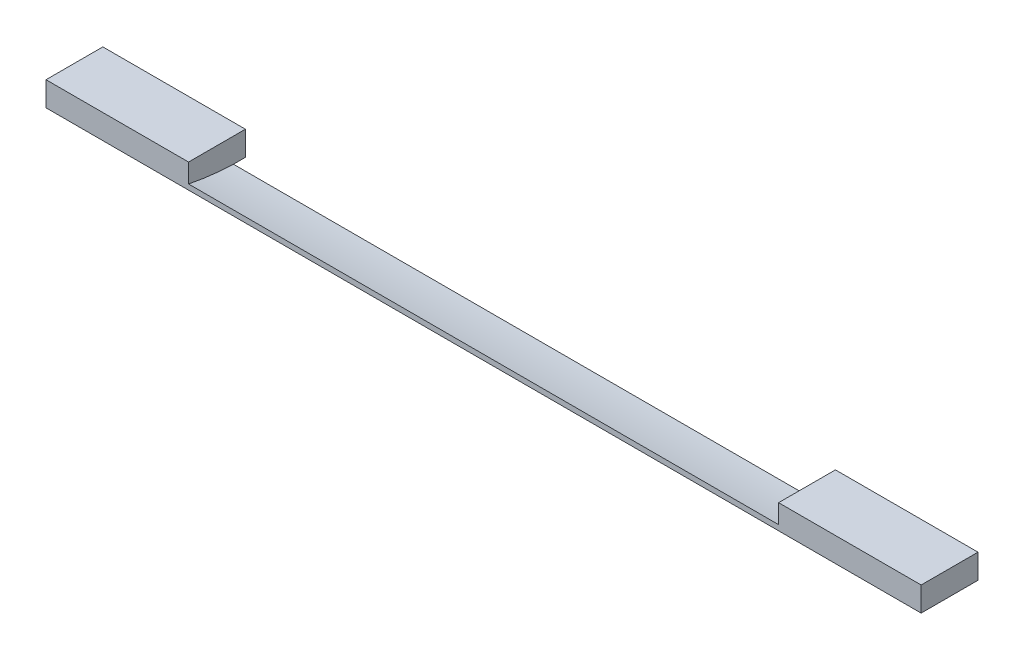
ISO-10303-21;
HEADER;
FILE_DESCRIPTION(('STEP AP214'),'2;1');
FILE_NAME('part.step','',(''),(''),'','','');
FILE_SCHEMA(('AUTOMOTIVE_DESIGN { 1 0 10303 214 1 1 1 1 }'));
ENDSEC;
DATA;
#1=APPLICATION_CONTEXT('core data for automotive mechanical design processes');
#2=APPLICATION_PROTOCOL_DEFINITION('international standard','automotive_design',2000,#1);
#3=PRODUCT_CONTEXT('',#1,'mechanical');
#4=PRODUCT('Part','Part','',(#3));
#5=PRODUCT_RELATED_PRODUCT_CATEGORY('part','',(#4));
#6=PRODUCT_DEFINITION_FORMATION('','',#4);
#7=PRODUCT_DEFINITION_CONTEXT('part definition',#1,'design');
#8=PRODUCT_DEFINITION('design','',#6,#7);
#9=PRODUCT_DEFINITION_SHAPE('','',#8);
#10=(LENGTH_UNIT() NAMED_UNIT(*) SI_UNIT(.MILLI.,.METRE.));
#11=(NAMED_UNIT(*) PLANE_ANGLE_UNIT() SI_UNIT($,.RADIAN.));
#12=(NAMED_UNIT(*) SI_UNIT($,.STERADIAN.) SOLID_ANGLE_UNIT());
#13=UNCERTAINTY_MEASURE_WITH_UNIT(LENGTH_MEASURE(1.E-05),#10,'distance_accuracy_value','');
#14=(GEOMETRIC_REPRESENTATION_CONTEXT(3) GLOBAL_UNCERTAINTY_ASSIGNED_CONTEXT((#13)) GLOBAL_UNIT_ASSIGNED_CONTEXT((#10,
#11,#12)) REPRESENTATION_CONTEXT('',''));
#15=CARTESIAN_POINT('',(0.,0.,0.));
#16=DIRECTION('',(0.,0.,1.));
#17=DIRECTION('',(1.,0.,0.));
#18=AXIS2_PLACEMENT_3D('',#15,#16,#17);
#19=CARTESIAN_POINT('',(-684.2125,38.1,0.));
#20=DIRECTION('',(0.,0.,-1.));
#21=DIRECTION('',(-1.,0.,0.));
#22=AXIS2_PLACEMENT_3D('',#19,#20,#21);
#23=PLANE('',#22);
#24=DIRECTION('',(0.,1.,0.));
#25=VECTOR('',#24,1.);
#26=CARTESIAN_POINT('',(461.3021,8.34320167705216,0.));
#27=LINE('',#26,#25);
#28=CARTESIAN_POINT('',(461.3021,8.34320167705216,-2.08166817117217E-13));
#29=VERTEX_POINT('',#28);
#30=CARTESIAN_POINT('',(461.3021,38.1,0.));
#31=VERTEX_POINT('',#30);
#32=EDGE_CURVE('E188',#29,#31,#27,.T.);
#33=ORIENTED_EDGE('',*,*,#32,.F.);
#34=DIRECTION('',(-1.,0.,0.));
#35=VECTOR('',#34,1.);
#36=CARTESIAN_POINT('',(461.3021,8.34320167705216,-2.08166817117217E-13));
#37=LINE('',#36,#35);
#38=CARTESIAN_POINT('',(-461.3021,8.34320167705216,-2.08166817117217E-13));
#39=VERTEX_POINT('',#38);
#40=EDGE_CURVE('E170',#29,#39,#37,.T.);
#41=ORIENTED_EDGE('',*,*,#40,.T.);
#42=DIRECTION('',(0.,1.,0.));
#43=VECTOR('',#42,1.);
#44=CARTESIAN_POINT('',(-461.3021,8.34320167705216,0.));
#45=LINE('',#44,#43);
#46=CARTESIAN_POINT('',(-461.3021,38.1,0.));
#47=VERTEX_POINT('',#46);
#48=EDGE_CURVE('E180',#39,#47,#45,.T.);
#49=ORIENTED_EDGE('',*,*,#48,.T.);
#50=DIRECTION('',(1.,0.,0.));
#51=VECTOR('',#50,1.);
#52=CARTESIAN_POINT('',(-684.2125,38.1,0.));
#53=LINE('',#52,#51);
#54=CARTESIAN_POINT('',(-684.2125,38.1,0.));
#55=VERTEX_POINT('',#54);
#56=EDGE_CURVE('E92',#55,#47,#53,.T.);
#57=ORIENTED_EDGE('',*,*,#56,.F.);
#58=DIRECTION('',(0.,-1.,0.));
#59=VECTOR('',#58,1.);
#60=CARTESIAN_POINT('',(-684.2125,38.1,0.));
#61=LINE('',#60,#59);
#62=CARTESIAN_POINT('',(-684.2125,0.,0.));
#63=VERTEX_POINT('',#62);
#64=EDGE_CURVE('E11',#55,#63,#61,.T.);
#65=ORIENTED_EDGE('',*,*,#64,.T.);
#66=DIRECTION('',(1.,0.,0.));
#67=VECTOR('',#66,1.);
#68=CARTESIAN_POINT('',(-684.2125,0.,0.));
#69=LINE('',#68,#67);
#70=CARTESIAN_POINT('',(684.2125,0.,0.));
#71=VERTEX_POINT('',#70);
#72=EDGE_CURVE('E167',#63,#71,#69,.T.);
#73=ORIENTED_EDGE('',*,*,#72,.T.);
#74=DIRECTION('',(0.,-1.,0.));
#75=VECTOR('',#74,1.);
#76=CARTESIAN_POINT('',(684.2125,38.1,0.));
#77=LINE('',#76,#75);
#78=CARTESIAN_POINT('',(684.2125,38.1,0.));
#79=VERTEX_POINT('',#78);
#80=EDGE_CURVE('E47',#79,#71,#77,.T.);
#81=ORIENTED_EDGE('',*,*,#80,.F.);
#82=EDGE_CURVE('E150',#31,#79,#53,.T.);
#83=ORIENTED_EDGE('',*,*,#82,.F.);
#84=EDGE_LOOP('',(#33,#41,#49,#57,#65,#73,#81,#83));
#85=FACE_BOUND('',#84,.T.);
#86=ADVANCED_FACE('F39',(#85),#23,.F.);
#87=CARTESIAN_POINT('',(-684.2125,38.1,-88.9));
#88=DIRECTION('',(0.,0.,1.));
#89=DIRECTION('',(1.,0.,0.));
#90=AXIS2_PLACEMENT_3D('',#87,#88,#89);
#91=PLANE('',#90);
#92=DIRECTION('',(0.,-1.,0.));
#93=VECTOR('',#92,1.);
#94=CARTESIAN_POINT('',(461.3021,38.1,-88.9));
#95=LINE('',#94,#93);
#96=CARTESIAN_POINT('',(461.3021,38.1,-88.9));
#97=VERTEX_POINT('',#96);
#98=CARTESIAN_POINT('',(461.3021,0.,-88.9));
#99=VERTEX_POINT('',#98);
#100=EDGE_CURVE('E121',#97,#99,#95,.T.);
#101=ORIENTED_EDGE('',*,*,#100,.F.);
#102=DIRECTION('',(-1.,0.,0.));
#103=VECTOR('',#102,1.);
#104=CARTESIAN_POINT('',(-684.2125,38.1,-88.9));
#105=LINE('',#104,#103);
#106=CARTESIAN_POINT('',(684.2125,38.1,-88.9));
#107=VERTEX_POINT('',#106);
#108=EDGE_CURVE('E158',#107,#97,#105,.T.);
#109=ORIENTED_EDGE('',*,*,#108,.F.);
#110=DIRECTION('',(0.,-1.,0.));
#111=VECTOR('',#110,1.);
#112=CARTESIAN_POINT('',(684.2125,38.1,-88.9));
#113=LINE('',#112,#111);
#114=CARTESIAN_POINT('',(684.2125,0.,-88.9));
#115=VERTEX_POINT('',#114);
#116=EDGE_CURVE('E147',#107,#115,#113,.T.);
#117=ORIENTED_EDGE('',*,*,#116,.T.);
#118=DIRECTION('',(-1.,0.,0.));
#119=VECTOR('',#118,1.);
#120=CARTESIAN_POINT('',(-684.2125,0.,-88.9));
#121=LINE('',#120,#119);
#122=EDGE_CURVE('E139',#115,#99,#121,.T.);
#123=ORIENTED_EDGE('',*,*,#122,.T.);
#124=EDGE_LOOP('',(#101,#109,#117,#123));
#125=FACE_BOUND('',#124,.T.);
#126=ADVANCED_FACE('F145',(#125),#91,.F.);
#127=CARTESIAN_POINT('',(0.,38.1,0.));
#128=DIRECTION('',(0.,-1.,0.));
#129=DIRECTION('',(0.,0.,-1.));
#130=AXIS2_PLACEMENT_3D('',#127,#128,#129);
#131=PLANE('',#130);
#132=DIRECTION('',(0.,0.,-1.));
#133=VECTOR('',#132,1.);
#134=CARTESIAN_POINT('',(461.3021,38.1,0.));
#135=LINE('',#134,#133);
#136=EDGE_CURVE('E128',#31,#97,#135,.T.);
#137=ORIENTED_EDGE('',*,*,#136,.F.);
#138=ORIENTED_EDGE('',*,*,#82,.T.);
#139=DIRECTION('',(0.,0.,-1.));
#140=VECTOR('',#139,1.);
#141=CARTESIAN_POINT('',(684.2125,38.1,0.));
#142=LINE('',#141,#140);
#143=EDGE_CURVE('E164',#79,#107,#142,.T.);
#144=ORIENTED_EDGE('',*,*,#143,.T.);
#145=ORIENTED_EDGE('',*,*,#108,.T.);
#146=EDGE_LOOP('',(#137,#138,#144,#145));
#147=FACE_BOUND('',#146,.T.);
#148=ADVANCED_FACE('F193',(#147),#131,.F.);
#149=CARTESIAN_POINT('',(0.,0.,0.));
#150=DIRECTION('',(0.,-1.,0.));
#151=DIRECTION('',(0.,0.,-1.));
#152=AXIS2_PLACEMENT_3D('',#149,#150,#151);
#153=PLANE('',#152);
#154=DIRECTION('',(-1.,0.,0.));
#155=VECTOR('',#154,1.);
#156=CARTESIAN_POINT('',(461.3021,0.,-70.1926972878016));
#157=LINE('',#156,#155);
#158=CARTESIAN_POINT('',(461.3021,0.,-70.1926972878016));
#159=VERTEX_POINT('',#158);
#160=CARTESIAN_POINT('',(-461.3021,0.,-70.1926972878016));
#161=VERTEX_POINT('',#160);
#162=EDGE_CURVE('E141',#159,#161,#157,.T.);
#163=ORIENTED_EDGE('',*,*,#162,.F.);
#164=DIRECTION('',(0.,0.,1.));
#165=VECTOR('',#164,1.);
#166=CARTESIAN_POINT('',(461.3021,0.,-88.9));
#167=LINE('',#166,#165);
#168=EDGE_CURVE('E125',#99,#159,#167,.T.);
#169=ORIENTED_EDGE('',*,*,#168,.F.);
#170=ORIENTED_EDGE('',*,*,#122,.F.);
#171=DIRECTION('',(0.,0.,-1.));
#172=VECTOR('',#171,1.);
#173=CARTESIAN_POINT('',(684.2125,0.,0.));
#174=LINE('',#173,#172);
#175=EDGE_CURVE('E152',#71,#115,#174,.T.);
#176=ORIENTED_EDGE('',*,*,#175,.F.);
#177=ORIENTED_EDGE('',*,*,#72,.F.);
#178=DIRECTION('',(0.,0.,1.));
#179=VECTOR('',#178,1.);
#180=CARTESIAN_POINT('',(-684.2125,0.,0.));
#181=LINE('',#180,#179);
#182=CARTESIAN_POINT('',(-684.2125,0.,-88.9));
#183=VERTEX_POINT('',#182);
#184=EDGE_CURVE('E168',#183,#63,#181,.T.);
#185=ORIENTED_EDGE('',*,*,#184,.F.);
#186=CARTESIAN_POINT('',(-461.3021,0.,-88.9));
#187=VERTEX_POINT('',#186);
#188=EDGE_CURVE('E85',#187,#183,#121,.T.);
#189=ORIENTED_EDGE('',*,*,#188,.F.);
#190=DIRECTION('',(0.,0.,1.));
#191=VECTOR('',#190,1.);
#192=CARTESIAN_POINT('',(-461.3021,0.,-88.9));
#193=LINE('',#192,#191);
#194=EDGE_CURVE('E183',#187,#161,#193,.T.);
#195=ORIENTED_EDGE('',*,*,#194,.T.);
#196=EDGE_LOOP('',(#163,#169,#170,#176,#177,#185,#189,#195));
#197=FACE_BOUND('',#196,.T.);
#198=ADVANCED_FACE('F137',(#197),#153,.T.);
#199=CARTESIAN_POINT('',(-684.2125,38.1,0.));
#200=DIRECTION('',(1.,0.,0.));
#201=DIRECTION('',(0.,0.,-1.));
#202=AXIS2_PLACEMENT_3D('',#199,#200,#201);
#203=PLANE('',#202);
#204=ORIENTED_EDGE('',*,*,#184,.T.);
#205=ORIENTED_EDGE('',*,*,#64,.F.);
#206=DIRECTION('',(0.,0.,1.));
#207=VECTOR('',#206,1.);
#208=CARTESIAN_POINT('',(-684.2125,38.1,0.));
#209=LINE('',#208,#207);
#210=CARTESIAN_POINT('',(-684.2125,38.1,-88.9));
#211=VERTEX_POINT('',#210);
#212=EDGE_CURVE('E148',#211,#55,#209,.T.);
#213=ORIENTED_EDGE('',*,*,#212,.F.);
#214=DIRECTION('',(0.,-1.,0.));
#215=VECTOR('',#214,1.);
#216=CARTESIAN_POINT('',(-684.2125,38.1,-88.9));
#217=LINE('',#216,#215);
#218=EDGE_CURVE('E156',#211,#183,#217,.T.);
#219=ORIENTED_EDGE('',*,*,#218,.T.);
#220=EDGE_LOOP('',(#204,#205,#213,#219));
#221=FACE_BOUND('',#220,.T.);
#222=ADVANCED_FACE('F41',(#221),#203,.F.);
#223=CARTESIAN_POINT('',(684.2125,38.1,0.));
#224=DIRECTION('',(-1.,0.,0.));
#225=DIRECTION('',(0.,0.,1.));
#226=AXIS2_PLACEMENT_3D('',#223,#224,#225);
#227=PLANE('',#226);
#228=ORIENTED_EDGE('',*,*,#175,.T.);
#229=ORIENTED_EDGE('',*,*,#116,.F.);
#230=ORIENTED_EDGE('',*,*,#143,.F.);
#231=ORIENTED_EDGE('',*,*,#80,.T.);
#232=EDGE_LOOP('',(#228,#229,#230,#231));
#233=FACE_BOUND('',#232,.T.);
#234=ADVANCED_FACE('F163',(#233),#227,.F.);
#235=CARTESIAN_POINT('',(-461.3021,38.1,-88.9));
#236=VERTEX_POINT('',#235);
#237=EDGE_CURVE('E63',#236,#211,#105,.T.);
#238=ORIENTED_EDGE('',*,*,#237,.F.);
#239=DIRECTION('',(0.,-1.,0.));
#240=VECTOR('',#239,1.);
#241=CARTESIAN_POINT('',(-461.3021,38.1,-88.9));
#242=LINE('',#241,#240);
#243=EDGE_CURVE('E185',#236,#187,#242,.T.);
#244=ORIENTED_EDGE('',*,*,#243,.T.);
#245=ORIENTED_EDGE('',*,*,#188,.T.);
#246=ORIENTED_EDGE('',*,*,#218,.F.);
#247=EDGE_LOOP('',(#238,#244,#245,#246));
#248=FACE_BOUND('',#247,.T.);
#249=ADVANCED_FACE('F203',(#248),#91,.F.);
#250=ORIENTED_EDGE('',*,*,#56,.T.);
#251=DIRECTION('',(0.,0.,-1.));
#252=VECTOR('',#251,1.);
#253=CARTESIAN_POINT('',(-461.3021,38.1,0.));
#254=LINE('',#253,#252);
#255=EDGE_CURVE('E133',#47,#236,#254,.T.);
#256=ORIENTED_EDGE('',*,*,#255,.T.);
#257=ORIENTED_EDGE('',*,*,#237,.T.);
#258=ORIENTED_EDGE('',*,*,#212,.T.);
#259=EDGE_LOOP('',(#250,#256,#257,#258));
#260=FACE_BOUND('',#259,.T.);
#261=ADVANCED_FACE('F196',(#260),#131,.F.);
#262=CARTESIAN_POINT('',(461.3021,433.324,-86.1060000000001));
#263=DIRECTION('',(-1.,0.,0.));
#264=DIRECTION('',(0.,0.,1.));
#265=AXIS2_PLACEMENT_3D('',#262,#263,#264);
#266=CYLINDRICAL_SURFACE('',#265,433.6161);
#267=CARTESIAN_POINT('',(-461.3021,433.324,-86.1060000000001));
#268=DIRECTION('',(-1.,0.,0.));
#269=DIRECTION('',(0.,0.,1.));
#270=AXIS2_PLACEMENT_3D('',#267,#268,#269);
#271=CIRCLE('',#270,433.6161);
#272=EDGE_CURVE('E54',#161,#39,#271,.T.);
#273=ORIENTED_EDGE('',*,*,#272,.T.);
#274=ORIENTED_EDGE('',*,*,#40,.F.);
#275=CARTESIAN_POINT('',(461.3021,433.324,-86.1060000000001));
#276=DIRECTION('',(-1.,0.,0.));
#277=DIRECTION('',(0.,0.,1.));
#278=AXIS2_PLACEMENT_3D('',#275,#276,#277);
#279=CIRCLE('',#278,433.6161);
#280=EDGE_CURVE('E142',#159,#29,#279,.T.);
#281=ORIENTED_EDGE('',*,*,#280,.F.);
#282=ORIENTED_EDGE('',*,*,#162,.T.);
#283=EDGE_LOOP('',(#273,#274,#281,#282));
#284=FACE_BOUND('',#283,.T.);
#285=ADVANCED_FACE('F206',(#284),#266,.F.);
#286=CARTESIAN_POINT('',(461.3021,433.324,-86.1060000000001));
#287=DIRECTION('',(-1.,0.,0.));
#288=DIRECTION('',(0.,0.,1.));
#289=AXIS2_PLACEMENT_3D('',#286,#287,#288);
#290=PLANE('',#289);
#291=ORIENTED_EDGE('',*,*,#100,.T.);
#292=ORIENTED_EDGE('',*,*,#168,.T.);
#293=ORIENTED_EDGE('',*,*,#280,.T.);
#294=ORIENTED_EDGE('',*,*,#32,.T.);
#295=ORIENTED_EDGE('',*,*,#136,.T.);
#296=EDGE_LOOP('',(#291,#292,#293,#294,#295));
#297=FACE_BOUND('',#296,.T.);
#298=ADVANCED_FACE('F123',(#297),#290,.T.);
#299=CARTESIAN_POINT('',(-461.3021,433.324,-86.1060000000001));
#300=DIRECTION('',(-1.,0.,0.));
#301=DIRECTION('',(0.,0.,1.));
#302=AXIS2_PLACEMENT_3D('',#299,#300,#301);
#303=PLANE('',#302);
#304=ORIENTED_EDGE('',*,*,#243,.F.);
#305=ORIENTED_EDGE('',*,*,#255,.F.);
#306=ORIENTED_EDGE('',*,*,#48,.F.);
#307=ORIENTED_EDGE('',*,*,#272,.F.);
#308=ORIENTED_EDGE('',*,*,#194,.F.);
#309=EDGE_LOOP('',(#304,#305,#306,#307,#308));
#310=FACE_BOUND('',#309,.T.);
#311=ADVANCED_FACE('F218',(#310),#303,.F.);
#312=CLOSED_SHELL('',(#86,#126,#148,#198,#222,#234,#249,#261,#285,#298,#311));
#313=MANIFOLD_SOLID_BREP('B2',#312);
#314=ADVANCED_BREP_SHAPE_REPRESENTATION('',(#18,#313),#14);
#315=SHAPE_DEFINITION_REPRESENTATION(#9,#314);
ENDSEC;
END-ISO-10303-21;
